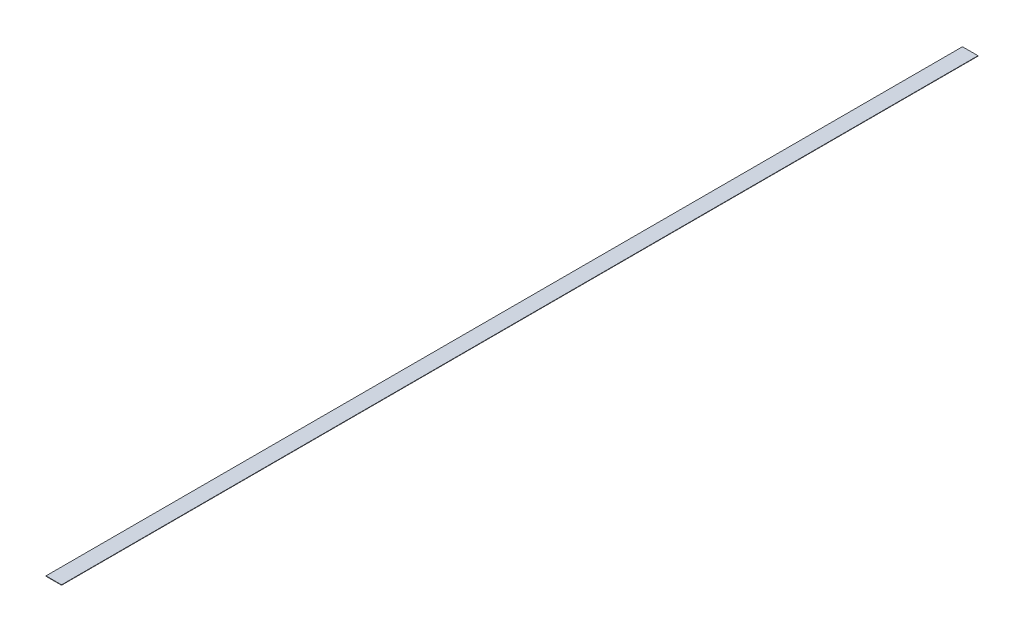
ISO-10303-21;
HEADER;
FILE_DESCRIPTION(('STEP AP214'),'2;1');
FILE_NAME('part.step','',(''),(''),'','','');
FILE_SCHEMA(('AUTOMOTIVE_DESIGN { 1 0 10303 214 1 1 1 1 }'));
ENDSEC;
DATA;
#1=APPLICATION_CONTEXT('core data for automotive mechanical design processes');
#2=APPLICATION_PROTOCOL_DEFINITION('international standard','automotive_design',2000,#1);
#3=PRODUCT_CONTEXT('',#1,'mechanical');
#4=PRODUCT('Part','Part','',(#3));
#5=PRODUCT_RELATED_PRODUCT_CATEGORY('part','',(#4));
#6=PRODUCT_DEFINITION_FORMATION('','',#4);
#7=PRODUCT_DEFINITION_CONTEXT('part definition',#1,'design');
#8=PRODUCT_DEFINITION('design','',#6,#7);
#9=PRODUCT_DEFINITION_SHAPE('','',#8);
#10=(LENGTH_UNIT() NAMED_UNIT(*) SI_UNIT(.MILLI.,.METRE.));
#11=(NAMED_UNIT(*) PLANE_ANGLE_UNIT() SI_UNIT($,.RADIAN.));
#12=(NAMED_UNIT(*) SI_UNIT($,.STERADIAN.) SOLID_ANGLE_UNIT());
#13=UNCERTAINTY_MEASURE_WITH_UNIT(LENGTH_MEASURE(1.E-05),#10,'distance_accuracy_value','');
#14=(GEOMETRIC_REPRESENTATION_CONTEXT(3) GLOBAL_UNCERTAINTY_ASSIGNED_CONTEXT((#13)) GLOBAL_UNIT_ASSIGNED_CONTEXT((#10,
#11,#12)) REPRESENTATION_CONTEXT('',''));
#15=CARTESIAN_POINT('',(0.,0.,0.));
#16=DIRECTION('',(0.,0.,1.));
#17=DIRECTION('',(1.,0.,0.));
#18=AXIS2_PLACEMENT_3D('',#15,#16,#17);
#19=CARTESIAN_POINT('',(-25.4,1.27,0.));
#20=DIRECTION('',(1.,0.,0.));
#21=DIRECTION('',(0.,0.,-1.));
#22=AXIS2_PLACEMENT_3D('',#19,#20,#21);
#23=PLANE('',#22);
#24=DIRECTION('',(0.,0.,1.));
#25=VECTOR('',#24,1.);
#26=CARTESIAN_POINT('',(-25.4,0.,0.));
#27=LINE('',#26,#25);
#28=CARTESIAN_POINT('',(-25.4,0.,-2997.2));
#29=VERTEX_POINT('',#28);
#30=CARTESIAN_POINT('',(-25.4,0.,0.));
#31=VERTEX_POINT('',#30);
#32=EDGE_CURVE('E96',#29,#31,#27,.T.);
#33=ORIENTED_EDGE('',*,*,#32,.T.);
#34=DIRECTION('',(0.,-1.,0.));
#35=VECTOR('',#34,1.);
#36=CARTESIAN_POINT('',(-25.4,1.27,0.));
#37=LINE('',#36,#35);
#38=CARTESIAN_POINT('',(-25.4,1.27,0.));
#39=VERTEX_POINT('',#38);
#40=EDGE_CURVE('E11',#39,#31,#37,.T.);
#41=ORIENTED_EDGE('',*,*,#40,.F.);
#42=DIRECTION('',(0.,0.,1.));
#43=VECTOR('',#42,1.);
#44=CARTESIAN_POINT('',(-25.4,1.27,0.));
#45=LINE('',#44,#43);
#46=CARTESIAN_POINT('',(-25.4,1.27,-2997.2));
#47=VERTEX_POINT('',#46);
#48=EDGE_CURVE('E84',#47,#39,#45,.T.);
#49=ORIENTED_EDGE('',*,*,#48,.F.);
#50=DIRECTION('',(0.,-1.,0.));
#51=VECTOR('',#50,1.);
#52=CARTESIAN_POINT('',(-25.4,1.27,-2997.2));
#53=LINE('',#52,#51);
#54=EDGE_CURVE('E92',#47,#29,#53,.T.);
#55=ORIENTED_EDGE('',*,*,#54,.T.);
#56=EDGE_LOOP('',(#33,#41,#49,#55));
#57=FACE_BOUND('',#56,.T.);
#58=ADVANCED_FACE('F33',(#57),#23,.F.);
#59=CARTESIAN_POINT('',(-25.4,1.27,0.));
#60=DIRECTION('',(0.,0.,-1.));
#61=DIRECTION('',(-1.,0.,0.));
#62=AXIS2_PLACEMENT_3D('',#59,#60,#61);
#63=PLANE('',#62);
#64=DIRECTION('',(1.,0.,0.));
#65=VECTOR('',#64,1.);
#66=CARTESIAN_POINT('',(-25.4,0.,0.));
#67=LINE('',#66,#65);
#68=CARTESIAN_POINT('',(25.4,0.,0.));
#69=VERTEX_POINT('',#68);
#70=EDGE_CURVE('E88',#31,#69,#67,.T.);
#71=ORIENTED_EDGE('',*,*,#70,.T.);
#72=DIRECTION('',(0.,-1.,0.));
#73=VECTOR('',#72,1.);
#74=CARTESIAN_POINT('',(25.4,1.27,0.));
#75=LINE('',#74,#73);
#76=CARTESIAN_POINT('',(25.4,1.27,0.));
#77=VERTEX_POINT('',#76);
#78=EDGE_CURVE('E41',#77,#69,#75,.T.);
#79=ORIENTED_EDGE('',*,*,#78,.F.);
#80=DIRECTION('',(1.,0.,0.));
#81=VECTOR('',#80,1.);
#82=CARTESIAN_POINT('',(-25.4,1.27,0.));
#83=LINE('',#82,#81);
#84=EDGE_CURVE('E79',#39,#77,#83,.T.);
#85=ORIENTED_EDGE('',*,*,#84,.F.);
#86=ORIENTED_EDGE('',*,*,#40,.T.);
#87=EDGE_LOOP('',(#71,#79,#85,#86));
#88=FACE_BOUND('',#87,.T.);
#89=ADVANCED_FACE('F87',(#88),#63,.F.);
#90=CARTESIAN_POINT('',(25.4,1.27,0.));
#91=DIRECTION('',(-1.,0.,0.));
#92=DIRECTION('',(0.,0.,1.));
#93=AXIS2_PLACEMENT_3D('',#90,#91,#92);
#94=PLANE('',#93);
#95=DIRECTION('',(0.,0.,-1.));
#96=VECTOR('',#95,1.);
#97=CARTESIAN_POINT('',(25.4,0.,0.));
#98=LINE('',#97,#96);
#99=CARTESIAN_POINT('',(25.4,0.,-2997.2));
#100=VERTEX_POINT('',#99);
#101=EDGE_CURVE('E66',#69,#100,#98,.T.);
#102=ORIENTED_EDGE('',*,*,#101,.T.);
#103=DIRECTION('',(0.,-1.,0.));
#104=VECTOR('',#103,1.);
#105=CARTESIAN_POINT('',(25.4,1.27,-2997.2));
#106=LINE('',#105,#104);
#107=CARTESIAN_POINT('',(25.4,1.27,-2997.2));
#108=VERTEX_POINT('',#107);
#109=EDGE_CURVE('E89',#108,#100,#106,.T.);
#110=ORIENTED_EDGE('',*,*,#109,.F.);
#111=DIRECTION('',(0.,0.,-1.));
#112=VECTOR('',#111,1.);
#113=CARTESIAN_POINT('',(25.4,1.27,0.));
#114=LINE('',#113,#112);
#115=EDGE_CURVE('E82',#77,#108,#114,.T.);
#116=ORIENTED_EDGE('',*,*,#115,.F.);
#117=ORIENTED_EDGE('',*,*,#78,.T.);
#118=EDGE_LOOP('',(#102,#110,#116,#117));
#119=FACE_BOUND('',#118,.T.);
#120=ADVANCED_FACE('F90',(#119),#94,.F.);
#121=CARTESIAN_POINT('',(-25.4,1.27,-2997.2));
#122=DIRECTION('',(0.,0.,1.));
#123=DIRECTION('',(1.,0.,0.));
#124=AXIS2_PLACEMENT_3D('',#121,#122,#123);
#125=PLANE('',#124);
#126=DIRECTION('',(-1.,0.,0.));
#127=VECTOR('',#126,1.);
#128=CARTESIAN_POINT('',(-25.4,0.,-2997.2));
#129=LINE('',#128,#127);
#130=EDGE_CURVE('E72',#100,#29,#129,.T.);
#131=ORIENTED_EDGE('',*,*,#130,.T.);
#132=ORIENTED_EDGE('',*,*,#54,.F.);
#133=DIRECTION('',(-1.,0.,0.));
#134=VECTOR('',#133,1.);
#135=CARTESIAN_POINT('',(-25.4,1.27,-2997.2));
#136=LINE('',#135,#134);
#137=EDGE_CURVE('E49',#108,#47,#136,.T.);
#138=ORIENTED_EDGE('',*,*,#137,.F.);
#139=ORIENTED_EDGE('',*,*,#109,.T.);
#140=EDGE_LOOP('',(#131,#132,#138,#139));
#141=FACE_BOUND('',#140,.T.);
#142=ADVANCED_FACE('F103',(#141),#125,.F.);
#143=CARTESIAN_POINT('',(0.,1.27,0.));
#144=DIRECTION('',(0.,-1.,0.));
#145=DIRECTION('',(0.,0.,-1.));
#146=AXIS2_PLACEMENT_3D('',#143,#144,#145);
#147=PLANE('',#146);
#148=ORIENTED_EDGE('',*,*,#48,.T.);
#149=ORIENTED_EDGE('',*,*,#84,.T.);
#150=ORIENTED_EDGE('',*,*,#115,.T.);
#151=ORIENTED_EDGE('',*,*,#137,.T.);
#152=EDGE_LOOP('',(#148,#149,#150,#151));
#153=FACE_BOUND('',#152,.T.);
#154=ADVANCED_FACE('F80',(#153),#147,.F.);
#155=CARTESIAN_POINT('',(0.,0.,0.));
#156=DIRECTION('',(0.,-1.,0.));
#157=DIRECTION('',(0.,0.,-1.));
#158=AXIS2_PLACEMENT_3D('',#155,#156,#157);
#159=PLANE('',#158);
#160=ORIENTED_EDGE('',*,*,#32,.F.);
#161=ORIENTED_EDGE('',*,*,#130,.F.);
#162=ORIENTED_EDGE('',*,*,#101,.F.);
#163=ORIENTED_EDGE('',*,*,#70,.F.);
#164=EDGE_LOOP('',(#160,#161,#162,#163));
#165=FACE_BOUND('',#164,.T.);
#166=ADVANCED_FACE('F106',(#165),#159,.T.);
#167=CLOSED_SHELL('',(#58,#89,#120,#142,#154,#166));
#168=MANIFOLD_SOLID_BREP('B2',#167);
#169=ADVANCED_BREP_SHAPE_REPRESENTATION('',(#18,#168),#14);
#170=SHAPE_DEFINITION_REPRESENTATION(#9,#169);
ENDSEC;
END-ISO-10303-21;
